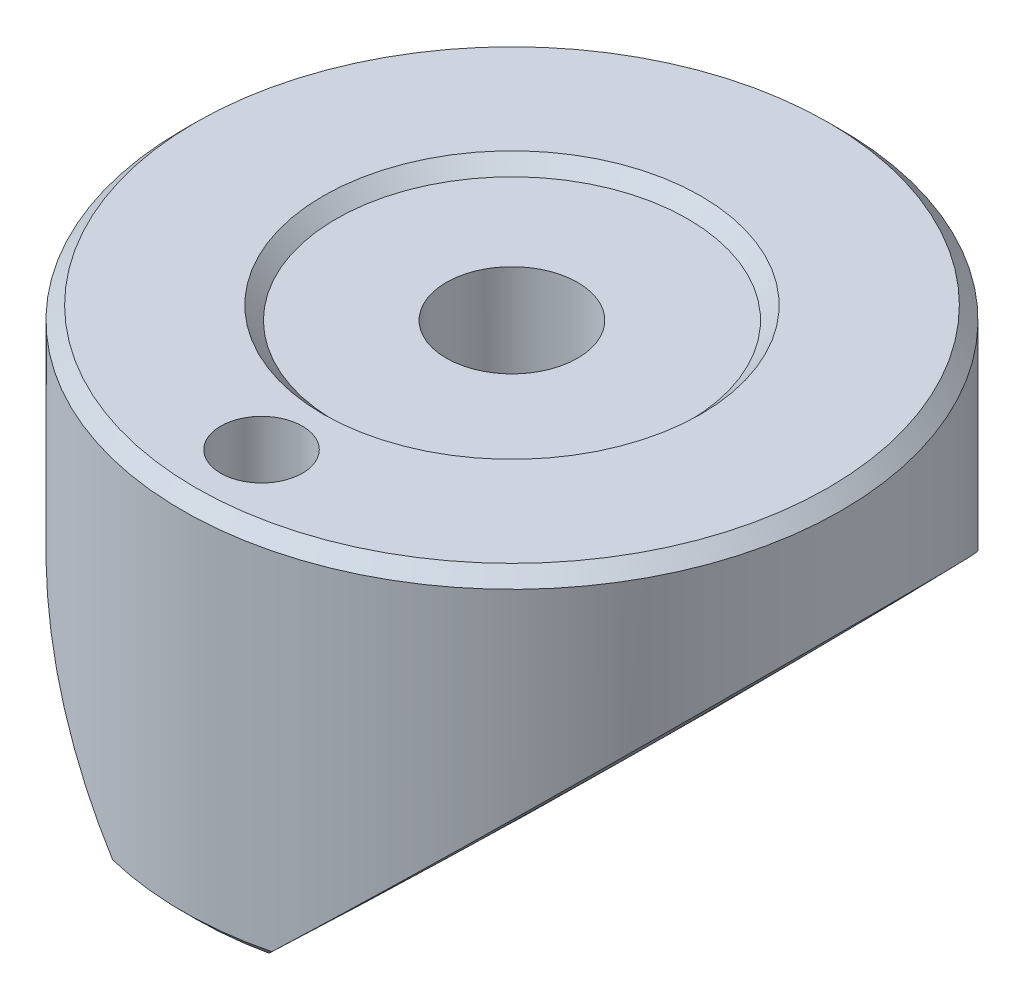
ISO-10303-21;
HEADER;
FILE_DESCRIPTION(('STEP AP214'),'2;1');
FILE_NAME('part.step','',(''),(''),'','','');
FILE_SCHEMA(('AUTOMOTIVE_DESIGN { 1 0 10303 214 1 1 1 1 }'));
ENDSEC;
DATA;
#1=APPLICATION_CONTEXT('core data for automotive mechanical design processes');
#2=APPLICATION_PROTOCOL_DEFINITION('international standard','automotive_design',2000,#1);
#3=PRODUCT_CONTEXT('',#1,'mechanical');
#4=PRODUCT('Part','Part','',(#3));
#5=PRODUCT_RELATED_PRODUCT_CATEGORY('part','',(#4));
#6=PRODUCT_DEFINITION_FORMATION('','',#4);
#7=PRODUCT_DEFINITION_CONTEXT('part definition',#1,'design');
#8=PRODUCT_DEFINITION('design','',#6,#7);
#9=PRODUCT_DEFINITION_SHAPE('','',#8);
#10=(LENGTH_UNIT() NAMED_UNIT(*) SI_UNIT(.MILLI.,.METRE.));
#11=(NAMED_UNIT(*) PLANE_ANGLE_UNIT() SI_UNIT($,.RADIAN.));
#12=(NAMED_UNIT(*) SI_UNIT($,.STERADIAN.) SOLID_ANGLE_UNIT());
#13=UNCERTAINTY_MEASURE_WITH_UNIT(LENGTH_MEASURE(1.E-05),#10,'distance_accuracy_value','');
#14=(GEOMETRIC_REPRESENTATION_CONTEXT(3) GLOBAL_UNCERTAINTY_ASSIGNED_CONTEXT((#13)) GLOBAL_UNIT_ASSIGNED_CONTEXT((#10,
#11,#12)) REPRESENTATION_CONTEXT('',''));
#15=CARTESIAN_POINT('',(0.,0.,0.));
#16=DIRECTION('',(0.,0.,1.));
#17=DIRECTION('',(1.,0.,0.));
#18=AXIS2_PLACEMENT_3D('',#15,#16,#17);
#19=CARTESIAN_POINT('',(0.,5.715,0.));
#20=DIRECTION('',(0.,1.,0.));
#21=DIRECTION('',(-1.,0.,0.));
#22=AXIS2_PLACEMENT_3D('',#19,#20,#21);
#23=CONICAL_SURFACE('',#22,9.14400000000001,0.785398163397446);
#24=CARTESIAN_POINT('',(2.29987119437756,6.09619999999998,9.2433774957681));
#25=CARTESIAN_POINT('',(2.23614814276285,6.03233509441633,9.19343280497743));
#26=CARTESIAN_POINT('',(2.17250329115637,5.96861931580852,9.14320206248056));
#27=CARTESIAN_POINT('',(2.04536995774871,5.84148598233343,9.04216845006548));
#28=CARTESIAN_POINT('',(1.98188147602186,5.77806842760791,8.99136557987535));
#29=CARTESIAN_POINT('',(1.91847119437757,5.71479999999998,8.94027665770714));
#30=B_SPLINE_CURVE_WITH_KNOTS('',3,(#24,#25,#26,#27,#28,#29),.UNSPECIFIED.,.F.,.F.,(4,2,4),(0.,
0.309356518668322,0.618713184363575),.UNSPECIFIED.);
#31=CARTESIAN_POINT('',(2.29967164046168,6.096,9.24322104820913));
#32=VERTEX_POINT('',#31);
#33=CARTESIAN_POINT('',(1.91867164046165,5.715,8.94043819597722));
#34=VERTEX_POINT('',#33);
#35=EDGE_CURVE('E11',#32,#34,#30,.T.);
#36=ORIENTED_EDGE('',*,*,#35,.F.);
#37=CARTESIAN_POINT('',(0.,6.096,0.));
#38=DIRECTION('',(0.,1.,0.));
#39=DIRECTION('',(-1.,0.,0.));
#40=AXIS2_PLACEMENT_3D('',#37,#38,#39);
#41=CIRCLE('',#40,9.525);
#42=CARTESIAN_POINT('',(-2.29967164046168,6.09599999999998,9.24322104820916));
#43=VERTEX_POINT('',#42);
#44=EDGE_CURVE('E98',#43,#32,#41,.T.);
#45=ORIENTED_EDGE('',*,*,#44,.F.);
#46=CARTESIAN_POINT('',(-1.91847119437759,5.71480000000002,8.94027665770718));
#47=CARTESIAN_POINT('',(-1.98188147602191,5.77806842760793,8.99136557987537));
#48=CARTESIAN_POINT('',(-2.04536995774877,5.84148598233344,9.04216845006547));
#49=CARTESIAN_POINT('',(-2.17250329115642,5.96861931580852,9.14320206248055));
#50=CARTESIAN_POINT('',(-2.23614814276288,6.03233509441634,9.19343280497743));
#51=CARTESIAN_POINT('',(-2.29987119437754,6.09620000000001,9.24337749576813));
#52=B_SPLINE_CURVE_WITH_KNOTS('',3,(#46,#47,#48,#49,#50,#51),.UNSPECIFIED.,.F.,.F.,(4,2,4),(0.,
0.309356665695235,0.618713184363541),.UNSPECIFIED.);
#53=CARTESIAN_POINT('',(-1.91867164046169,5.715,8.9404381959772));
#54=VERTEX_POINT('',#53);
#55=EDGE_CURVE('E112',#54,#43,#52,.T.);
#56=ORIENTED_EDGE('',*,*,#55,.F.);
#57=CARTESIAN_POINT('',(0.,5.715,0.));
#58=DIRECTION('',(0.,1.,0.));
#59=DIRECTION('',(-1.,0.,0.));
#60=AXIS2_PLACEMENT_3D('',#57,#58,#59);
#61=CIRCLE('',#60,9.14400000000001);
#62=EDGE_CURVE('E60',#34,#54,#61,.F.);
#63=ORIENTED_EDGE('',*,*,#62,.F.);
#64=EDGE_LOOP('',(#36,#45,#56,#63));
#65=FACE_BOUND('',#64,.T.);
#66=ADVANCED_FACE('F37',(#65),#23,.T.);
#67=CARTESIAN_POINT('',(0.,5.715,0.));
#68=DIRECTION('',(0.,1.,0.));
#69=DIRECTION('',(-1.,0.,0.));
#70=AXIS2_PLACEMENT_3D('',#67,#68,#69);
#71=PLANE('',#70);
#72=CARTESIAN_POINT('',(-1.91867164046168,5.715,-8.94043819597721));
#73=VERTEX_POINT('',#72);
#74=CARTESIAN_POINT('',(1.91867164046167,5.715,-8.94043819597721));
#75=VERTEX_POINT('',#74);
#76=EDGE_CURVE('E106',#73,#75,#61,.F.);
#77=ORIENTED_EDGE('',*,*,#76,.T.);
#78=CARTESIAN_POINT('',(-170.909475953966,5.71499999999997,0.));
#79=DIRECTION('',(0.,1.,0.));
#80=DIRECTION('',(-1.,0.,0.));
#81=AXIS2_PLACEMENT_3D('',#78,#79,#80);
#82=CIRCLE('',#81,173.059238516924);
#83=EDGE_CURVE('E53',#75,#34,#82,.F.);
#84=ORIENTED_EDGE('',*,*,#83,.T.);
#85=ORIENTED_EDGE('',*,*,#62,.T.);
#86=CARTESIAN_POINT('',(170.909475953966,5.71500000000003,0.));
#87=DIRECTION('',(0.,1.,0.));
#88=DIRECTION('',(-1.,0.,0.));
#89=AXIS2_PLACEMENT_3D('',#86,#87,#88);
#90=CIRCLE('',#89,173.059238516924);
#91=EDGE_CURVE('E143',#54,#73,#90,.F.);
#92=ORIENTED_EDGE('',*,*,#91,.T.);
#93=EDGE_LOOP('',(#77,#84,#85,#92));
#94=FACE_BOUND('',#93,.T.);
#95=CARTESIAN_POINT('',(0.,5.715,7.239));
#96=DIRECTION('',(0.,1.,0.));
#97=DIRECTION('',(-1.,0.,0.));
#98=AXIS2_PLACEMENT_3D('',#95,#96,#97);
#99=CIRCLE('',#98,1.1811);
#100=CARTESIAN_POINT('',(-1.1811,5.715,7.239));
#101=VERTEX_POINT('',#100);
#102=EDGE_CURVE('E213',#101,#101,#99,.F.);
#103=ORIENTED_EDGE('',*,*,#102,.F.);
#104=EDGE_LOOP('',(#103));
#105=FACE_BOUND('',#104,.T.);
#106=ADVANCED_FACE('F151',(#94,#105),#71,.F.);
#107=CARTESIAN_POINT('',(-9.525,16.51,0.));
#108=DIRECTION('',(0.,-1.,0.));
#109=DIRECTION('',(1.,0.,0.));
#110=AXIS2_PLACEMENT_3D('',#107,#108,#109);
#111=PLANE('',#110);
#112=CARTESIAN_POINT('',(0.,16.51,0.));
#113=DIRECTION('',(0.,-1.,0.));
#114=DIRECTION('',(1.,0.,0.));
#115=AXIS2_PLACEMENT_3D('',#112,#113,#114);
#116=CIRCLE('',#115,5.461);
#117=CARTESIAN_POINT('',(5.461,16.51,0.));
#118=VERTEX_POINT('',#117);
#119=EDGE_CURVE('E41',#118,#118,#116,.T.);
#120=ORIENTED_EDGE('',*,*,#119,.T.);
#121=EDGE_LOOP('',(#120));
#122=FACE_BOUND('',#121,.T.);
#123=CARTESIAN_POINT('',(0.,16.51,0.));
#124=DIRECTION('',(0.,-1.,0.));
#125=DIRECTION('',(1.,0.,0.));
#126=AXIS2_PLACEMENT_3D('',#123,#124,#125);
#127=CIRCLE('',#126,9.14400000000001);
#128=CARTESIAN_POINT('',(9.14400000000001,16.51,0.));
#129=VERTEX_POINT('',#128);
#130=EDGE_CURVE('E104',#129,#129,#127,.F.);
#131=ORIENTED_EDGE('',*,*,#130,.T.);
#132=EDGE_LOOP('',(#131));
#133=FACE_BOUND('',#132,.T.);
#134=CARTESIAN_POINT('',(0.,16.51,7.239));
#135=DIRECTION('',(0.,1.,0.));
#136=DIRECTION('',(0.,0.,1.));
#137=AXIS2_PLACEMENT_3D('',#134,#135,#136);
#138=CIRCLE('',#137,1.1811);
#139=CARTESIAN_POINT('',(0.,16.51,8.4201));
#140=VERTEX_POINT('',#139);
#141=EDGE_CURVE('E212',#140,#140,#138,.T.);
#142=ORIENTED_EDGE('',*,*,#141,.F.);
#143=EDGE_LOOP('',(#142));
#144=FACE_BOUND('',#143,.T.);
#145=ADVANCED_FACE('F149',(#122,#133,#144),#111,.F.);
#146=CARTESIAN_POINT('',(0.,5.715,0.));
#147=DIRECTION('',(0.,-1.,0.));
#148=DIRECTION('',(1.,0.,0.));
#149=AXIS2_PLACEMENT_3D('',#146,#147,#148);
#150=CYLINDRICAL_SURFACE('',#149,9.525);
#151=ORIENTED_EDGE('',*,*,#44,.T.);
#152=CARTESIAN_POINT('',(2.29946093994318,6.09579999999996,9.24327346699619));
#153=CARTESIAN_POINT('',(2.44236269467777,6.23144420356484,9.20772026803801));
#154=CARTESIAN_POINT('',(2.58473442417828,6.36673892154863,9.16878656244503));
#155=CARTESIAN_POINT('',(2.86826236023861,6.63647557678154,9.08408515876558));
#156=CARTESIAN_POINT('',(3.00941849870498,6.77091746614828,9.03831708043986));
#157=CARTESIAN_POINT('',(3.43108134388741,7.17297260396278,8.89056199453204));
#158=CARTESIAN_POINT('',(3.7095022122566,7.43904926410698,8.77819341511232));
#159=CARTESIAN_POINT('',(4.26162380332831,7.96784846147799,8.52393532816298));
#160=CARTESIAN_POINT('',(4.53525270970079,8.23051356796929,8.38177048822999));
#161=CARTESIAN_POINT('',(5.07285777773427,8.74769070646846,8.06774965389066));
#162=CARTESIAN_POINT('',(5.33683856381051,9.00220663698863,7.89590811600918));
#163=CARTESIAN_POINT('',(5.79645440506814,9.44626262326055,7.56232993524234));
#164=CARTESIAN_POINT('',(5.99443848346254,9.63786696114372,7.40656384634724));
#165=CARTESIAN_POINT('',(6.38166439740536,10.0132022351085,7.0756520573852));
#166=CARTESIAN_POINT('',(6.57090454340081,10.1969316490597,6.90050263397281));
#167=CARTESIAN_POINT('',(6.93831101602061,10.5541708770921,6.53093792901795));
#168=CARTESIAN_POINT('',(7.11651002421163,10.7277107634239,6.33658440716957));
#169=CARTESIAN_POINT('',(7.46045065197301,11.0631251596436,5.92778338974347));
#170=CARTESIAN_POINT('',(7.62619477983716,11.2250020180817,5.71333995973113));
#171=CARTESIAN_POINT('',(7.90627921311279,11.4988999903976,5.31611028383407));
#172=CARTESIAN_POINT('',(8.02365342230199,11.6138037265731,5.13744371117203));
#173=CARTESIAN_POINT('',(8.24837452743125,11.8339949174793,4.76829232470046));
#174=CARTESIAN_POINT('',(8.35572393063424,11.9392847765501,4.57781048589996));
#175=CARTESIAN_POINT('',(8.55900029469921,12.1388239888616,4.18544258568895));
#176=CARTESIAN_POINT('',(8.65493350546713,12.2330793825649,3.98356285425843));
#177=CARTESIAN_POINT('',(8.83397742842739,12.4091168006217,3.56895290911988));
#178=CARTESIAN_POINT('',(8.91709029457962,12.490900920261,3.35622452611438));
#179=CARTESIAN_POINT('',(9.05639681173513,12.6280611915786,2.95707247555612));
#180=CARTESIAN_POINT('',(9.11476887442479,12.6855675113233,2.7721388262016));
#181=CARTESIAN_POINT('',(9.22071038651711,12.789980335514,2.39629423210312));
#182=CARTESIAN_POINT('',(9.26828191681274,12.8368888817797,2.20538444683498));
#183=CARTESIAN_POINT('',(9.35184553430315,12.9193134077941,1.81871218808096));
#184=CARTESIAN_POINT('',(9.38784279077246,12.9548344733713,1.62295192309776));
#185=CARTESIAN_POINT('',(9.44765166950955,13.0138642631595,1.22777577990161));
#186=CARTESIAN_POINT('',(9.47146314993285,13.0373728475431,1.02835985916421));
#187=CARTESIAN_POINT('',(9.50651159843756,13.0719787886644,0.626625018146457));
#188=CARTESIAN_POINT('',(9.51770332001863,13.0830314863636,0.424298269659884));
#189=CARTESIAN_POINT('',(9.52713706438352,13.092347902979,0.0190466667563174));
#190=CARTESIAN_POINT('',(9.5253790763464,13.0906116112086,-0.183878188160319));
#191=CARTESIAN_POINT('',(9.50894847490223,13.0743858452114,-0.588698456680256));
#192=CARTESIAN_POINT('',(9.49427517243547,13.0598956905388,-0.790593814779641));
#193=CARTESIAN_POINT('',(9.45230107167041,13.0184552359909,-1.19176554373992));
#194=CARTESIAN_POINT('',(9.42500045564923,12.991505115977,-1.39104195236304));
#195=CARTESIAN_POINT('',(9.36007987758499,12.9274397568523,-1.77492886690405));
#196=CARTESIAN_POINT('',(9.32309328807484,12.8909485903687,-1.95975202742871));
#197=CARTESIAN_POINT('',(9.23883637695264,12.8078539740406,-2.3247861177771));
#198=CARTESIAN_POINT('',(9.19156215708661,12.7612466909507,-2.50499527022187));
#199=CARTESIAN_POINT('',(9.08741213300846,12.6586159879857,-2.85985318075821));
#200=CARTESIAN_POINT('',(9.03053650964454,12.602592745466,-3.03450204350754));
#201=CARTESIAN_POINT('',(8.90790426879808,12.4818661463662,-3.37758361130653));
#202=CARTESIAN_POINT('',(8.84214586843191,12.4171610472473,-3.54601505978037));
#203=CARTESIAN_POINT('',(8.67608813386111,12.2538660503943,-3.93853924878026));
#204=CARTESIAN_POINT('',(8.57212659776906,12.1517114843261,-4.15961313241463));
#205=CARTESIAN_POINT('',(8.35064083819996,11.9342927102309,-4.58809755869133));
#206=CARTESIAN_POINT('',(8.23311249822317,11.8190245233651,-4.79550392412933));
#207=CARTESIAN_POINT('',(7.98608267704465,11.577010198809,-5.19650328098451));
#208=CARTESIAN_POINT('',(7.85656317507492,11.4502467917336,-5.39007468105403));
#209=CARTESIAN_POINT('',(7.58730406600753,11.1870269408215,-5.76292781338118));
#210=CARTESIAN_POINT('',(7.44756415769656,11.0505702113092,-5.94220912415912));
#211=CARTESIAN_POINT('',(7.10719395190379,10.7186105915701,-6.34876676433083));
#212=CARTESIAN_POINT('',(6.90278991873729,10.5195719090437,-6.57001199684244));
#213=CARTESIAN_POINT('',(6.48057308821371,10.1091822569183,-6.98683478471638));
#214=CARTESIAN_POINT('',(6.26275506012165,9.89782648606613,-7.18240223282633));
#215=CARTESIAN_POINT('',(5.81579460033106,9.46494444705822,-7.54889568526233));
#216=CARTESIAN_POINT('',(5.58663237782224,9.24340045626778,-7.71977643047264));
#217=CARTESIAN_POINT('',(5.11940998588984,8.79259000601871,-8.03722699373038));
#218=CARTESIAN_POINT('',(4.88135165833644,8.56332514606746,-8.18380181033552));
#219=CARTESIAN_POINT('',(4.45106587168166,8.14975747483001,-8.42379214572748));
#220=CARTESIAN_POINT('',(4.26025003602094,7.96663323023808,-8.52181377783792));
#221=CARTESIAN_POINT('',(3.87488623225229,7.59738247684026,-8.70380835600084));
#222=CARTESIAN_POINT('',(3.68033851621902,7.41125617094668,-8.78778224722738));
#223=CARTESIAN_POINT('',(3.28947820073744,7.03790696583826,-8.94140715420182));
#224=CARTESIAN_POINT('',(3.09318706254225,6.85070051200485,-9.0111530623226));
#225=CARTESIAN_POINT('',(2.69808525066396,6.47447944692104,-9.13722606663412));
#226=CARTESIAN_POINT('',(2.49927486272233,6.28546504132011,-9.19355467056208));
#227=CARTESIAN_POINT('',(2.29946093994318,6.09579999999995,-9.24327346699618));
#228=B_SPLINE_CURVE_WITH_KNOTS('',3,(#152,#153,#154,#155,#156,#157,#158,#159,#160,#161,#162,
#163,#164,#165,#166,#167,#168,#169,#170,#171,#172,#173,#174,#175,#176,#177,#178,#179,#180,#181,
#182,#183,#184,#185,#186,#187,#188,#189,#190,#191,#192,#193,#194,#195,#196,#197,#198,#199,#200,
#201,#202,#203,#204,#205,#206,#207,#208,#209,#210,#211,#212,#213,#214,#215,#216,#217,#218,#219,
#220,#221,#222,#223,#224,#225,#226,#227),.UNSPECIFIED.,.F.,.F.,(4,2,2,2,2,2,2,2,2,2,2,2,2,2,2,2,
2,2,2,2,2,2,2,2,2,2,2,2,2,2,2,2,2,2,2,2,2,4),(0.,0.600570432722538,1.20117429142372,
2.40355718743699,3.61758350407939,4.83102008699352,5.77979978337465,6.72876204826481,
7.67476610331464,8.62057912874784,9.34805578951955,10.0753500140562,10.8022442244644,
11.5290161752627,12.1352316362962,12.7413302010547,13.3471576943,13.9529922393178,
14.5609920863346,15.1689924414032,15.7770252365603,16.3850492549495,16.9603995748055,
17.5359682908498,18.1115261669213,18.6871997367299,19.4804189970129,20.2738795751949,
21.0685525755891,21.863249005836,22.9447642794037,24.0267039893284,25.1106027529438,
26.1942783336536,27.0400540821185,27.8857729013512,28.7256522434531,29.5654371615668),.UNSPECIFIED.);
#229=CARTESIAN_POINT('',(2.29967164046167,6.09599999999999,-9.24322104820918));
#230=VERTEX_POINT('',#229);
#231=EDGE_CURVE('E82',#32,#230,#228,.T.);
#232=ORIENTED_EDGE('',*,*,#231,.T.);
#233=CARTESIAN_POINT('',(-2.29967164046167,6.096,-9.24322104820913));
#234=VERTEX_POINT('',#233);
#235=EDGE_CURVE('E95',#230,#234,#41,.T.);
#236=ORIENTED_EDGE('',*,*,#235,.T.);
#237=CARTESIAN_POINT('',(-2.29946093994317,6.09579999999996,-9.24327346699619));
#238=CARTESIAN_POINT('',(-2.44236269467773,6.23144420356488,-9.20772026803802));
#239=CARTESIAN_POINT('',(-2.58473442417824,6.36673892154868,-9.16878656244504));
#240=CARTESIAN_POINT('',(-2.86826236023858,6.63647557678157,-9.08408515876559));
#241=CARTESIAN_POINT('',(-3.00941849870496,6.77091746614829,-9.03831708043986));
#242=CARTESIAN_POINT('',(-3.43108134388742,7.17297260396275,-8.89056199453204));
#243=CARTESIAN_POINT('',(-3.7095022122566,7.43904926410698,-8.77819341511232));
#244=CARTESIAN_POINT('',(-4.2616238033283,7.96784846147799,-8.52393532816298));
#245=CARTESIAN_POINT('',(-4.53525270970079,8.23051356796929,-8.38177048822999));
#246=CARTESIAN_POINT('',(-5.07285777773427,8.74769070646845,-8.06774965389066));
#247=CARTESIAN_POINT('',(-5.33683856381051,9.00220663698862,-7.89590811600917));
#248=CARTESIAN_POINT('',(-5.79645440506814,9.44626262326055,-7.56232993524234));
#249=CARTESIAN_POINT('',(-5.99443848346254,9.63786696114372,-7.40656384634724));
#250=CARTESIAN_POINT('',(-6.38166439740536,10.0132022351085,-7.0756520573852));
#251=CARTESIAN_POINT('',(-6.57090454340081,10.1969316490597,-6.90050263397281));
#252=CARTESIAN_POINT('',(-6.93831101602061,10.5541708770921,-6.53093792901795));
#253=CARTESIAN_POINT('',(-7.11651002421163,10.7277107634239,-6.33658440716957));
#254=CARTESIAN_POINT('',(-7.46045065197301,11.0631251596436,-5.92778338974347));
#255=CARTESIAN_POINT('',(-7.62619477983716,11.2250020180817,-5.71333995973113));
#256=CARTESIAN_POINT('',(-7.90627921311278,11.4988999903976,-5.31611028383406));
#257=CARTESIAN_POINT('',(-8.02365342230199,11.613803726573,-5.13744371117203));
#258=CARTESIAN_POINT('',(-8.24837452743125,11.8339949174793,-4.76829232470046));
#259=CARTESIAN_POINT('',(-8.35572393063424,11.9392847765501,-4.57781048589996));
#260=CARTESIAN_POINT('',(-8.55900029469921,12.1388239888615,-4.18544258568895));
#261=CARTESIAN_POINT('',(-8.65493350546712,12.2330793825649,-3.98356285425843));
#262=CARTESIAN_POINT('',(-8.83397742842739,12.4091168006217,-3.56895290911988));
#263=CARTESIAN_POINT('',(-8.91709029457962,12.490900920261,-3.35622452611437));
#264=CARTESIAN_POINT('',(-9.05639681173513,12.6280611915786,-2.95707247555612));
#265=CARTESIAN_POINT('',(-9.11476887442478,12.6855675113233,-2.7721388262016));
#266=CARTESIAN_POINT('',(-9.22071038651711,12.789980335514,-2.39629423210312));
#267=CARTESIAN_POINT('',(-9.26828191681274,12.8368888817797,-2.20538444683498));
#268=CARTESIAN_POINT('',(-9.35184553430315,12.9193134077941,-1.81871218808096));
#269=CARTESIAN_POINT('',(-9.38784279077246,12.9548344733713,-1.62295192309776));
#270=CARTESIAN_POINT('',(-9.44765166950955,13.0138642631595,-1.22777577990161));
#271=CARTESIAN_POINT('',(-9.47146314993286,13.0373728475431,-1.02835985916422));
#272=CARTESIAN_POINT('',(-9.50651159843757,13.0719787886644,-0.626625018146459));
#273=CARTESIAN_POINT('',(-9.51770332001864,13.0830314863636,-0.424298269659886));
#274=CARTESIAN_POINT('',(-9.52713706438352,13.092347902979,-0.0190466667563184));
#275=CARTESIAN_POINT('',(-9.5253790763464,13.0906116112086,0.183878188160319));
#276=CARTESIAN_POINT('',(-9.50894847490223,13.0743858452114,0.588698456680256));
#277=CARTESIAN_POINT('',(-9.49427517243547,13.0598956905388,0.79059381477964));
#278=CARTESIAN_POINT('',(-9.45230107167041,13.0184552359909,1.19176554373992));
#279=CARTESIAN_POINT('',(-9.42500045564923,12.991505115977,1.39104195236304));
#280=CARTESIAN_POINT('',(-9.36007987758499,12.9274397568523,1.77492886690405));
#281=CARTESIAN_POINT('',(-9.32309328807484,12.8909485903687,1.9597520274287));
#282=CARTESIAN_POINT('',(-9.23883637695264,12.8078539740406,2.3247861177771));
#283=CARTESIAN_POINT('',(-9.19156215708661,12.7612466909507,2.50499527022187));
#284=CARTESIAN_POINT('',(-9.08741213300846,12.6586159879857,2.85985318075821));
#285=CARTESIAN_POINT('',(-9.03053650964454,12.602592745466,3.03450204350754));
#286=CARTESIAN_POINT('',(-8.90790426879808,12.4818661463662,3.37758361130653));
#287=CARTESIAN_POINT('',(-8.84214586843191,12.4171610472473,3.54601505978037));
#288=CARTESIAN_POINT('',(-8.67608813386111,12.2538660503943,3.93853924878026));
#289=CARTESIAN_POINT('',(-8.57212659776905,12.1517114843261,4.15961313241462));
#290=CARTESIAN_POINT('',(-8.35064083819995,11.9342927102309,4.58809755869132));
#291=CARTESIAN_POINT('',(-8.23311249822317,11.8190245233651,4.79550392412933));
#292=CARTESIAN_POINT('',(-7.98608267704465,11.577010198809,5.19650328098451));
#293=CARTESIAN_POINT('',(-7.85656317507492,11.4502467917336,5.39007468105402));
#294=CARTESIAN_POINT('',(-7.58730406600753,11.1870269408215,5.76292781338117));
#295=CARTESIAN_POINT('',(-7.44756415769656,11.0505702113092,5.94220912415911));
#296=CARTESIAN_POINT('',(-7.10719395190379,10.7186105915701,6.34876676433083));
#297=CARTESIAN_POINT('',(-6.90278991873729,10.5195719090437,6.57001199684243));
#298=CARTESIAN_POINT('',(-6.48057308821371,10.1091822569183,6.98683478471637));
#299=CARTESIAN_POINT('',(-6.26275506012165,9.89782648606614,7.18240223282633));
#300=CARTESIAN_POINT('',(-5.81579460033107,9.46494444705823,7.54889568526232));
#301=CARTESIAN_POINT('',(-5.58663237782224,9.24340045626778,7.71977643047264));
#302=CARTESIAN_POINT('',(-5.11940998588984,8.79259000601872,8.03722699373037));
#303=CARTESIAN_POINT('',(-4.88135165833645,8.56332514606746,8.18380181033551));
#304=CARTESIAN_POINT('',(-4.45106587168167,8.14975747483001,8.42379214572747));
#305=CARTESIAN_POINT('',(-4.26025003602094,7.96663323023809,8.52181377783791));
#306=CARTESIAN_POINT('',(-3.87488623225229,7.59738247684027,8.70380835600084));
#307=CARTESIAN_POINT('',(-3.68033851621902,7.41125617094668,8.78778224722738));
#308=CARTESIAN_POINT('',(-3.28947820073744,7.03790696583826,8.94140715420182));
#309=CARTESIAN_POINT('',(-3.09318706254224,6.85070051200486,9.0111530623226));
#310=CARTESIAN_POINT('',(-2.69808525066396,6.47447944692104,9.13722606663412));
#311=CARTESIAN_POINT('',(-2.49927486272233,6.28546504132012,9.19355467056208));
#312=CARTESIAN_POINT('',(-2.29946093994318,6.09579999999995,9.24327346699618));
#313=B_SPLINE_CURVE_WITH_KNOTS('',3,(#237,#238,#239,#240,#241,#242,#243,#244,#245,#246,#247,
#248,#249,#250,#251,#252,#253,#254,#255,#256,#257,#258,#259,#260,#261,#262,#263,#264,#265,#266,
#267,#268,#269,#270,#271,#272,#273,#274,#275,#276,#277,#278,#279,#280,#281,#282,#283,#284,#285,
#286,#287,#288,#289,#290,#291,#292,#293,#294,#295,#296,#297,#298,#299,#300,#301,#302,#303,#304,
#305,#306,#307,#308,#309,#310,#311,#312),.UNSPECIFIED.,.F.,.F.,(4,2,2,2,2,2,2,2,2,2,2,2,2,2,2,2,
2,2,2,2,2,2,2,2,2,2,2,2,2,2,2,2,2,2,2,2,2,4),(0.,0.600570432722537,1.20117429142372,
2.40355718743699,3.61758350407939,4.83102008699352,5.77979978337465,6.72876204826481,
7.67476610331464,8.62057912874784,9.34805578951955,10.0753500140562,10.8022442244644,
11.5290161752627,12.1352316362962,12.7413302010547,13.3471576943,13.9529922393178,
14.5609920863346,15.1689924414032,15.7770252365603,16.3850492549495,16.9603995748055,
17.5359682908498,18.1115261669213,18.6871997367299,19.4804189970129,20.2738795751949,
21.0685525755891,21.863249005836,22.9447642794037,24.0267039893284,25.1106027529438,
26.1942783336536,27.0400540821185,27.8857729013512,28.7256522434531,29.5654371615668),.UNSPECIFIED.);
#314=EDGE_CURVE('E136',#234,#43,#313,.T.);
#315=ORIENTED_EDGE('',*,*,#314,.T.);
#316=EDGE_LOOP('',(#151,#232,#236,#315));
#317=FACE_BOUND('',#316,.T.);
#318=CARTESIAN_POINT('',(0.,16.129,0.));
#319=DIRECTION('',(0.,-1.,0.));
#320=DIRECTION('',(1.,0.,0.));
#321=AXIS2_PLACEMENT_3D('',#318,#319,#320);
#322=CIRCLE('',#321,9.525);
#323=CARTESIAN_POINT('',(9.525,16.129,0.));
#324=VERTEX_POINT('',#323);
#325=EDGE_CURVE('E102',#324,#324,#322,.T.);
#326=ORIENTED_EDGE('',*,*,#325,.T.);
#327=EDGE_LOOP('',(#326));
#328=FACE_BOUND('',#327,.T.);
#329=ADVANCED_FACE('F92',(#317,#328),#150,.T.);
#330=CARTESIAN_POINT('',(0.,16.51,7.239));
#331=DIRECTION('',(0.,-1.,0.));
#332=DIRECTION('',(0.,0.,-1.));
#333=AXIS2_PLACEMENT_3D('',#330,#331,#332);
#334=CYLINDRICAL_SURFACE('',#333,1.1811);
#335=ORIENTED_EDGE('',*,*,#141,.T.);
#336=EDGE_LOOP('',(#335));
#337=FACE_BOUND('',#336,.T.);
#338=ORIENTED_EDGE('',*,*,#102,.T.);
#339=EDGE_LOOP('',(#338));
#340=FACE_BOUND('',#339,.T.);
#341=ADVANCED_FACE('F148',(#337,#340),#334,.F.);
#342=CARTESIAN_POINT('',(1.91847119437754,5.71479999999999,-8.94027665770716));
#343=CARTESIAN_POINT('',(1.98188147602186,5.77806842760791,-8.99136557987535));
#344=CARTESIAN_POINT('',(2.04536995774872,5.84148598233342,-9.04216845006546));
#345=CARTESIAN_POINT('',(2.17250329115638,5.96861931580851,-9.14320206248055));
#346=CARTESIAN_POINT('',(2.23614814276284,6.03233509441634,-9.19343280497743));
#347=CARTESIAN_POINT('',(2.29987119437751,6.0962,-9.24337749576813));
#348=B_SPLINE_CURVE_WITH_KNOTS('',3,(#342,#343,#344,#345,#346,#347),.UNSPECIFIED.,.F.,.F.,(4,2,
4),(0.,0.309356665695252,0.618713184363575),.UNSPECIFIED.);
#349=EDGE_CURVE('E46',#75,#230,#348,.T.);
#350=ORIENTED_EDGE('',*,*,#349,.F.);
#351=ORIENTED_EDGE('',*,*,#76,.F.);
#352=CARTESIAN_POINT('',(-2.29987119437754,6.09620000000001,-9.24337749576813));
#353=CARTESIAN_POINT('',(-2.23614814276288,6.03233509441634,-9.19343280497743));
#354=CARTESIAN_POINT('',(-2.17250329115642,5.96861931580852,-9.14320206248055));
#355=CARTESIAN_POINT('',(-2.04536995774876,5.84148598233344,-9.04216845006547));
#356=CARTESIAN_POINT('',(-1.9818814760219,5.77806842760794,-8.99136557987537));
#357=CARTESIAN_POINT('',(-1.91847119437758,5.71480000000002,-8.94027665770718));
#358=B_SPLINE_CURVE_WITH_KNOTS('',3,(#352,#353,#354,#355,#356,#357),.UNSPECIFIED.,.F.,.F.,(4,2,
4),(0.,0.309356518668306,0.618713184363542),.UNSPECIFIED.);
#359=EDGE_CURVE('E88',#234,#73,#358,.T.);
#360=ORIENTED_EDGE('',*,*,#359,.F.);
#361=ORIENTED_EDGE('',*,*,#235,.F.);
#362=EDGE_LOOP('',(#350,#351,#360,#361));
#363=FACE_BOUND('',#362,.T.);
#364=ADVANCED_FACE('F101',(#363),#23,.T.);
#365=CARTESIAN_POINT('',(0.,16.129,0.));
#366=DIRECTION('',(0.,-1.,0.));
#367=DIRECTION('',(1.,0.,0.));
#368=AXIS2_PLACEMENT_3D('',#365,#366,#367);
#369=CONICAL_SURFACE('',#368,9.525,0.785398163397437);
#370=ORIENTED_EDGE('',*,*,#130,.F.);
#371=EDGE_LOOP('',(#370));
#372=FACE_BOUND('',#371,.T.);
#373=ORIENTED_EDGE('',*,*,#325,.F.);
#374=EDGE_LOOP('',(#373));
#375=FACE_BOUND('',#374,.T.);
#376=ADVANCED_FACE('F39',(#372,#375),#369,.T.);
#377=CARTESIAN_POINT('',(170.909475953966,186.149475953966,0.));
#378=DIRECTION('',(0.,1.,0.));
#379=DIRECTION('',(-1.,0.,0.));
#380=AXIS2_PLACEMENT_3D('',#377,#378,#379);
#381=SPHERICAL_SURFACE('',#380,250.0122);
#382=ORIENTED_EDGE('',*,*,#359,.T.);
#383=ORIENTED_EDGE('',*,*,#91,.F.);
#384=ORIENTED_EDGE('',*,*,#55,.T.);
#385=ORIENTED_EDGE('',*,*,#314,.F.);
#386=EDGE_LOOP('',(#382,#383,#384,#385));
#387=FACE_BOUND('',#386,.T.);
#388=ADVANCED_FACE('F123',(#387),#381,.T.);
#389=CARTESIAN_POINT('',(-170.909475953966,186.149475953966,0.));
#390=DIRECTION('',(0.,1.,0.));
#391=DIRECTION('',(1.,0.,0.));
#392=AXIS2_PLACEMENT_3D('',#389,#390,#391);
#393=SPHERICAL_SURFACE('',#392,250.0122);
#394=ORIENTED_EDGE('',*,*,#35,.T.);
#395=ORIENTED_EDGE('',*,*,#83,.F.);
#396=ORIENTED_EDGE('',*,*,#349,.T.);
#397=ORIENTED_EDGE('',*,*,#231,.F.);
#398=EDGE_LOOP('',(#394,#395,#396,#397));
#399=FACE_BOUND('',#398,.T.);
#400=ADVANCED_FACE('F81',(#399),#393,.T.);
#401=CARTESIAN_POINT('',(0.,16.129,0.));
#402=DIRECTION('',(0.,1.,0.));
#403=DIRECTION('',(0.,0.,1.));
#404=AXIS2_PLACEMENT_3D('',#401,#402,#403);
#405=CONICAL_SURFACE('',#404,5.08,0.785398163397448);
#406=CARTESIAN_POINT('',(0.,16.129,0.));
#407=DIRECTION('',(0.,-1.,0.));
#408=DIRECTION('',(0.,0.,-1.));
#409=AXIS2_PLACEMENT_3D('',#406,#407,#408);
#410=CIRCLE('',#409,5.08);
#411=CARTESIAN_POINT('',(0.,16.129,-5.08));
#412=VERTEX_POINT('',#411);
#413=EDGE_CURVE('E157',#412,#412,#410,.T.);
#414=ORIENTED_EDGE('',*,*,#413,.T.);
#415=EDGE_LOOP('',(#414));
#416=FACE_BOUND('',#415,.T.);
#417=ORIENTED_EDGE('',*,*,#119,.F.);
#418=EDGE_LOOP('',(#417));
#419=FACE_BOUND('',#418,.T.);
#420=ADVANCED_FACE('F176',(#416,#419),#405,.F.);
#421=CARTESIAN_POINT('',(0.,16.129,0.));
#422=DIRECTION('',(0.,-1.,0.));
#423=DIRECTION('',(0.,0.,-1.));
#424=AXIS2_PLACEMENT_3D('',#421,#422,#423);
#425=PLANE('',#424);
#426=ORIENTED_EDGE('',*,*,#413,.F.);
#427=EDGE_LOOP('',(#426));
#428=FACE_BOUND('',#427,.T.);
#429=CARTESIAN_POINT('',(0.,16.129,0.));
#430=DIRECTION('',(0.,-1.,0.));
#431=DIRECTION('',(0.,0.,-1.));
#432=AXIS2_PLACEMENT_3D('',#429,#430,#431);
#433=CIRCLE('',#432,1.89864999999999);
#434=CARTESIAN_POINT('',(0.,16.129,-1.89864999999999));
#435=VERTEX_POINT('',#434);
#436=EDGE_CURVE('E159',#435,#435,#433,.F.);
#437=ORIENTED_EDGE('',*,*,#436,.F.);
#438=EDGE_LOOP('',(#437));
#439=FACE_BOUND('',#438,.T.);
#440=ADVANCED_FACE('F178',(#428,#439),#425,.F.);
#441=CARTESIAN_POINT('',(0.,10.16,0.));
#442=DIRECTION('',(0.,1.,0.));
#443=DIRECTION('',(0.,0.,1.));
#444=AXIS2_PLACEMENT_3D('',#441,#442,#443);
#445=CONICAL_SURFACE('',#444,1.89865,1.02974425867665);
#446=CARTESIAN_POINT('',(0.,9.01917598568332,0.));
#447=VERTEX_POINT('',#446);
#448=VERTEX_LOOP('',#447);
#449=FACE_BOUND('',#448,.T.);
#450=CARTESIAN_POINT('',(0.,10.16,0.));
#451=DIRECTION('',(0.,1.,0.));
#452=DIRECTION('',(0.,0.,1.));
#453=AXIS2_PLACEMENT_3D('',#450,#451,#452);
#454=CIRCLE('',#453,1.89865);
#455=CARTESIAN_POINT('',(0.,10.16,1.89865));
#456=VERTEX_POINT('',#455);
#457=EDGE_CURVE('E210',#456,#456,#454,.T.);
#458=ORIENTED_EDGE('',*,*,#457,.T.);
#459=EDGE_LOOP('',(#458));
#460=FACE_BOUND('',#459,.T.);
#461=ADVANCED_FACE('F184',(#449,#460),#445,.F.);
#462=CARTESIAN_POINT('',(0.,16.51,0.));
#463=DIRECTION('',(0.,1.,0.));
#464=DIRECTION('',(0.,0.,1.));
#465=AXIS2_PLACEMENT_3D('',#462,#463,#464);
#466=CYLINDRICAL_SURFACE('',#465,1.89864999999999);
#467=ORIENTED_EDGE('',*,*,#436,.T.);
#468=EDGE_LOOP('',(#467));
#469=FACE_BOUND('',#468,.T.);
#470=ORIENTED_EDGE('',*,*,#457,.F.);
#471=EDGE_LOOP('',(#470));
#472=FACE_BOUND('',#471,.T.);
#473=ADVANCED_FACE('F131',(#469,#472),#466,.F.);
#474=CLOSED_SHELL('',(#66,#106,#145,#329,#341,#364,#376,#388,#400,#420,#440,#461,#473));
#475=MANIFOLD_SOLID_BREP('B2',#474);
#476=ADVANCED_BREP_SHAPE_REPRESENTATION('',(#18,#475),#14);
#477=SHAPE_DEFINITION_REPRESENTATION(#9,#476);
ENDSEC;
END-ISO-10303-21;
